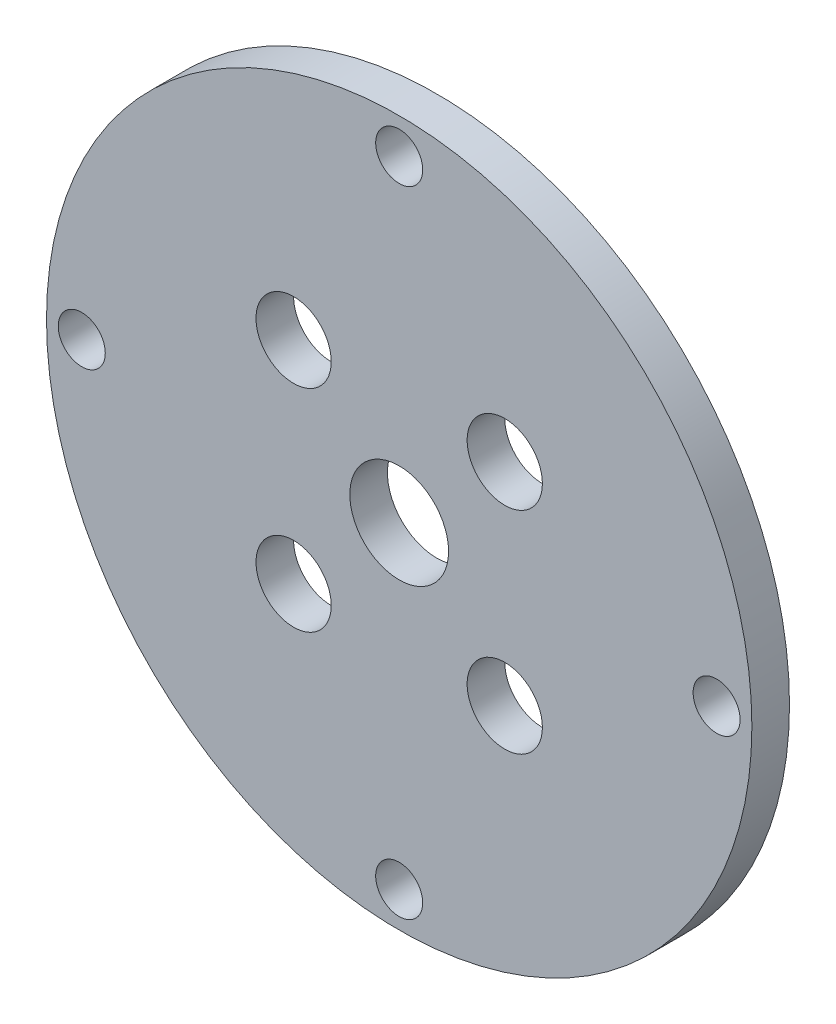
ISO-10303-21;
HEADER;
FILE_DESCRIPTION(('STEP AP214'),'2;1');
FILE_NAME('part.step','',(''),(''),'','','');
FILE_SCHEMA(('AUTOMOTIVE_DESIGN { 1 0 10303 214 1 1 1 1 }'));
ENDSEC;
DATA;
#1=APPLICATION_CONTEXT('core data for automotive mechanical design processes');
#2=APPLICATION_PROTOCOL_DEFINITION('international standard','automotive_design',2000,#1);
#3=PRODUCT_CONTEXT('',#1,'mechanical');
#4=PRODUCT('Part','Part','',(#3));
#5=PRODUCT_RELATED_PRODUCT_CATEGORY('part','',(#4));
#6=PRODUCT_DEFINITION_FORMATION('','',#4);
#7=PRODUCT_DEFINITION_CONTEXT('part definition',#1,'design');
#8=PRODUCT_DEFINITION('design','',#6,#7);
#9=PRODUCT_DEFINITION_SHAPE('','',#8);
#10=(LENGTH_UNIT() NAMED_UNIT(*) SI_UNIT(.MILLI.,.METRE.));
#11=(NAMED_UNIT(*) PLANE_ANGLE_UNIT() SI_UNIT($,.RADIAN.));
#12=(NAMED_UNIT(*) SI_UNIT($,.STERADIAN.) SOLID_ANGLE_UNIT());
#13=UNCERTAINTY_MEASURE_WITH_UNIT(LENGTH_MEASURE(1.E-05),#10,'distance_accuracy_value','');
#14=(GEOMETRIC_REPRESENTATION_CONTEXT(3) GLOBAL_UNCERTAINTY_ASSIGNED_CONTEXT((#13)) GLOBAL_UNIT_ASSIGNED_CONTEXT((#10,
#11,#12)) REPRESENTATION_CONTEXT('',''));
#15=CARTESIAN_POINT('',(0.,0.,0.));
#16=DIRECTION('',(0.,0.,1.));
#17=DIRECTION('',(1.,0.,0.));
#18=AXIS2_PLACEMENT_3D('',#15,#16,#17);
#19=CARTESIAN_POINT('',(0.,0.,1.6));
#20=DIRECTION('',(0.,0.,1.));
#21=DIRECTION('',(1.,0.,0.));
#22=AXIS2_PLACEMENT_3D('',#19,#20,#21);
#23=PLANE('',#22);
#24=CARTESIAN_POINT('',(7.62426335084362E-13,-13.5,1.6));
#25=DIRECTION('',(0.,0.,1.));
#26=DIRECTION('',(1.,0.,0.));
#27=AXIS2_PLACEMENT_3D('',#24,#25,#26);
#28=CIRCLE('',#27,1.00000000000082);
#29=CARTESIAN_POINT('',(1.00000000000158,-13.5,1.6));
#30=VERTEX_POINT('',#29);
#31=EDGE_CURVE('E83',#30,#30,#28,.T.);
#32=ORIENTED_EDGE('',*,*,#31,.F.);
#33=EDGE_LOOP('',(#32));
#34=FACE_BOUND('',#33,.T.);
#35=CARTESIAN_POINT('',(-4.49012806053458,4.49012806053432,1.6));
#36=DIRECTION('',(0.,0.,1.));
#37=DIRECTION('',(1.,0.,0.));
#38=AXIS2_PLACEMENT_3D('',#35,#36,#37);
#39=CIRCLE('',#38,1.60000000000027);
#40=CARTESIAN_POINT('',(-2.8901280605343,4.49012806053432,1.6));
#41=VERTEX_POINT('',#40);
#42=EDGE_CURVE('E71',#41,#41,#39,.T.);
#43=ORIENTED_EDGE('',*,*,#42,.F.);
#44=EDGE_LOOP('',(#43));
#45=FACE_BOUND('',#44,.T.);
#46=CARTESIAN_POINT('',(4.49012806053483,-4.49012806053458,1.6));
#47=DIRECTION('',(0.,0.,1.));
#48=DIRECTION('',(1.,0.,0.));
#49=AXIS2_PLACEMENT_3D('',#46,#47,#48);
#50=CIRCLE('',#49,1.59999999999994);
#51=CARTESIAN_POINT('',(6.09012806053476,-4.49012806053458,1.6));
#52=VERTEX_POINT('',#51);
#53=EDGE_CURVE('E59',#52,#52,#50,.T.);
#54=ORIENTED_EDGE('',*,*,#53,.F.);
#55=EDGE_LOOP('',(#54));
#56=FACE_BOUND('',#55,.T.);
#57=CARTESIAN_POINT('',(0.,0.,1.6));
#58=DIRECTION('',(0.,0.,1.));
#59=DIRECTION('',(1.,0.,0.));
#60=AXIS2_PLACEMENT_3D('',#57,#58,#59);
#61=CIRCLE('',#60,2.1);
#62=CARTESIAN_POINT('',(2.1,0.,1.6));
#63=VERTEX_POINT('',#62);
#64=EDGE_CURVE('E47',#63,#63,#61,.T.);
#65=ORIENTED_EDGE('',*,*,#64,.F.);
#66=EDGE_LOOP('',(#65));
#67=FACE_BOUND('',#66,.T.);
#68=CARTESIAN_POINT('',(0.,0.,1.6));
#69=DIRECTION('',(0.,0.,1.));
#70=DIRECTION('',(1.,0.,0.));
#71=AXIS2_PLACEMENT_3D('',#68,#69,#70);
#72=CIRCLE('',#71,15.);
#73=CARTESIAN_POINT('',(15.,0.,1.6));
#74=VERTEX_POINT('',#73);
#75=EDGE_CURVE('E10',#74,#74,#72,.T.);
#76=ORIENTED_EDGE('',*,*,#75,.T.);
#77=EDGE_LOOP('',(#76));
#78=FACE_BOUND('',#77,.T.);
#79=CARTESIAN_POINT('',(0.,13.5,1.6));
#80=DIRECTION('',(0.,0.,1.));
#81=DIRECTION('',(1.,0.,0.));
#82=AXIS2_PLACEMENT_3D('',#79,#80,#81);
#83=CIRCLE('',#82,1.);
#84=CARTESIAN_POINT('',(1.,13.5,1.6));
#85=VERTEX_POINT('',#84);
#86=EDGE_CURVE('E42',#85,#85,#83,.T.);
#87=ORIENTED_EDGE('',*,*,#86,.F.);
#88=EDGE_LOOP('',(#87));
#89=FACE_BOUND('',#88,.T.);
#90=CARTESIAN_POINT('',(4.49012806053458,4.49012806053458,1.6));
#91=DIRECTION('',(0.,0.,1.));
#92=DIRECTION('',(1.,0.,0.));
#93=AXIS2_PLACEMENT_3D('',#90,#91,#92);
#94=CIRCLE('',#93,1.6);
#95=CARTESIAN_POINT('',(6.09012806053458,4.49012806053458,1.6));
#96=VERTEX_POINT('',#95);
#97=EDGE_CURVE('E53',#96,#96,#94,.T.);
#98=ORIENTED_EDGE('',*,*,#97,.F.);
#99=EDGE_LOOP('',(#98));
#100=FACE_BOUND('',#99,.T.);
#101=CARTESIAN_POINT('',(-4.49012806053432,-4.49012806053483,1.6));
#102=DIRECTION('',(0.,0.,1.));
#103=DIRECTION('',(1.,0.,0.));
#104=AXIS2_PLACEMENT_3D('',#101,#102,#103);
#105=CIRCLE('',#104,1.60000000000019);
#106=CARTESIAN_POINT('',(-2.89012806053413,-4.49012806053483,1.6));
#107=VERTEX_POINT('',#106);
#108=EDGE_CURVE('E65',#107,#107,#105,.T.);
#109=ORIENTED_EDGE('',*,*,#108,.F.);
#110=EDGE_LOOP('',(#109));
#111=FACE_BOUND('',#110,.T.);
#112=CARTESIAN_POINT('',(13.5000000000004,3.81213167542181E-13,1.6));
#113=DIRECTION('',(0.,0.,1.));
#114=DIRECTION('',(1.,0.,0.));
#115=AXIS2_PLACEMENT_3D('',#112,#113,#114);
#116=CIRCLE('',#115,1.0000000000003);
#117=CARTESIAN_POINT('',(14.5000000000007,3.81213167542181E-13,1.6));
#118=VERTEX_POINT('',#117);
#119=EDGE_CURVE('E77',#118,#118,#116,.T.);
#120=ORIENTED_EDGE('',*,*,#119,.F.);
#121=EDGE_LOOP('',(#120));
#122=FACE_BOUND('',#121,.T.);
#123=CARTESIAN_POINT('',(-13.4999999999996,-3.8286644072103E-13,1.6));
#124=DIRECTION('',(0.,0.,1.));
#125=DIRECTION('',(1.,0.,0.));
#126=AXIS2_PLACEMENT_3D('',#123,#124,#125);
#127=CIRCLE('',#126,1.00000000000061);
#128=CARTESIAN_POINT('',(-12.499999999999,-3.8286644072103E-13,1.6));
#129=VERTEX_POINT('',#128);
#130=EDGE_CURVE('E89',#129,#129,#127,.T.);
#131=ORIENTED_EDGE('',*,*,#130,.F.);
#132=EDGE_LOOP('',(#131));
#133=FACE_BOUND('',#132,.T.);
#134=ADVANCED_FACE('F31',(#34,#45,#56,#67,#78,#89,#100,#111,#122,#133),#23,.T.);
#135=CARTESIAN_POINT('',(0.,0.,0.));
#136=DIRECTION('',(0.,0.,1.));
#137=DIRECTION('',(1.,0.,0.));
#138=AXIS2_PLACEMENT_3D('',#135,#136,#137);
#139=PLANE('',#138);
#140=CARTESIAN_POINT('',(0.,0.,0.));
#141=DIRECTION('',(0.,0.,1.));
#142=DIRECTION('',(1.,0.,0.));
#143=AXIS2_PLACEMENT_3D('',#140,#141,#142);
#144=CIRCLE('',#143,15.);
#145=CARTESIAN_POINT('',(15.,0.,0.));
#146=VERTEX_POINT('',#145);
#147=EDGE_CURVE('E35',#146,#146,#144,.T.);
#148=ORIENTED_EDGE('',*,*,#147,.F.);
#149=EDGE_LOOP('',(#148));
#150=FACE_BOUND('',#149,.T.);
#151=CARTESIAN_POINT('',(0.,13.5,0.));
#152=DIRECTION('',(0.,0.,1.));
#153=DIRECTION('',(1.,0.,0.));
#154=AXIS2_PLACEMENT_3D('',#151,#152,#153);
#155=CIRCLE('',#154,1.);
#156=CARTESIAN_POINT('',(1.,13.5,0.));
#157=VERTEX_POINT('',#156);
#158=EDGE_CURVE('E44',#157,#157,#155,.T.);
#159=ORIENTED_EDGE('',*,*,#158,.T.);
#160=EDGE_LOOP('',(#159));
#161=FACE_BOUND('',#160,.T.);
#162=CARTESIAN_POINT('',(0.,0.,0.));
#163=DIRECTION('',(0.,0.,1.));
#164=DIRECTION('',(1.,0.,0.));
#165=AXIS2_PLACEMENT_3D('',#162,#163,#164);
#166=CIRCLE('',#165,2.1);
#167=CARTESIAN_POINT('',(2.1,0.,0.));
#168=VERTEX_POINT('',#167);
#169=EDGE_CURVE('E50',#168,#168,#166,.T.);
#170=ORIENTED_EDGE('',*,*,#169,.T.);
#171=EDGE_LOOP('',(#170));
#172=FACE_BOUND('',#171,.T.);
#173=CARTESIAN_POINT('',(4.49012806053458,4.49012806053458,0.));
#174=DIRECTION('',(0.,0.,1.));
#175=DIRECTION('',(1.,0.,0.));
#176=AXIS2_PLACEMENT_3D('',#173,#174,#175);
#177=CIRCLE('',#176,1.6);
#178=CARTESIAN_POINT('',(6.09012806053458,4.49012806053458,0.));
#179=VERTEX_POINT('',#178);
#180=EDGE_CURVE('E56',#179,#179,#177,.T.);
#181=ORIENTED_EDGE('',*,*,#180,.T.);
#182=EDGE_LOOP('',(#181));
#183=FACE_BOUND('',#182,.T.);
#184=CARTESIAN_POINT('',(4.49012806053483,-4.49012806053458,0.));
#185=DIRECTION('',(0.,0.,1.));
#186=DIRECTION('',(1.,0.,0.));
#187=AXIS2_PLACEMENT_3D('',#184,#185,#186);
#188=CIRCLE('',#187,1.59999999999994);
#189=CARTESIAN_POINT('',(6.09012806053476,-4.49012806053458,0.));
#190=VERTEX_POINT('',#189);
#191=EDGE_CURVE('E62',#190,#190,#188,.T.);
#192=ORIENTED_EDGE('',*,*,#191,.T.);
#193=EDGE_LOOP('',(#192));
#194=FACE_BOUND('',#193,.T.);
#195=CARTESIAN_POINT('',(-4.49012806053432,-4.49012806053483,0.));
#196=DIRECTION('',(0.,0.,1.));
#197=DIRECTION('',(1.,0.,0.));
#198=AXIS2_PLACEMENT_3D('',#195,#196,#197);
#199=CIRCLE('',#198,1.60000000000019);
#200=CARTESIAN_POINT('',(-2.89012806053413,-4.49012806053483,0.));
#201=VERTEX_POINT('',#200);
#202=EDGE_CURVE('E68',#201,#201,#199,.T.);
#203=ORIENTED_EDGE('',*,*,#202,.T.);
#204=EDGE_LOOP('',(#203));
#205=FACE_BOUND('',#204,.T.);
#206=CARTESIAN_POINT('',(-4.49012806053458,4.49012806053432,0.));
#207=DIRECTION('',(0.,0.,1.));
#208=DIRECTION('',(1.,0.,0.));
#209=AXIS2_PLACEMENT_3D('',#206,#207,#208);
#210=CIRCLE('',#209,1.60000000000027);
#211=CARTESIAN_POINT('',(-2.8901280605343,4.49012806053432,0.));
#212=VERTEX_POINT('',#211);
#213=EDGE_CURVE('E74',#212,#212,#210,.T.);
#214=ORIENTED_EDGE('',*,*,#213,.T.);
#215=EDGE_LOOP('',(#214));
#216=FACE_BOUND('',#215,.T.);
#217=CARTESIAN_POINT('',(13.5000000000004,3.81213167542181E-13,0.));
#218=DIRECTION('',(0.,0.,1.));
#219=DIRECTION('',(1.,0.,0.));
#220=AXIS2_PLACEMENT_3D('',#217,#218,#219);
#221=CIRCLE('',#220,1.0000000000003);
#222=CARTESIAN_POINT('',(14.5000000000007,3.81213167542181E-13,0.));
#223=VERTEX_POINT('',#222);
#224=EDGE_CURVE('E80',#223,#223,#221,.T.);
#225=ORIENTED_EDGE('',*,*,#224,.T.);
#226=EDGE_LOOP('',(#225));
#227=FACE_BOUND('',#226,.T.);
#228=CARTESIAN_POINT('',(7.62426335084362E-13,-13.5,0.));
#229=DIRECTION('',(0.,0.,1.));
#230=DIRECTION('',(1.,0.,0.));
#231=AXIS2_PLACEMENT_3D('',#228,#229,#230);
#232=CIRCLE('',#231,1.00000000000082);
#233=CARTESIAN_POINT('',(1.00000000000158,-13.5,0.));
#234=VERTEX_POINT('',#233);
#235=EDGE_CURVE('E86',#234,#234,#232,.T.);
#236=ORIENTED_EDGE('',*,*,#235,.T.);
#237=EDGE_LOOP('',(#236));
#238=FACE_BOUND('',#237,.T.);
#239=CARTESIAN_POINT('',(-13.4999999999996,-3.8286644072103E-13,0.));
#240=DIRECTION('',(0.,0.,1.));
#241=DIRECTION('',(1.,0.,0.));
#242=AXIS2_PLACEMENT_3D('',#239,#240,#241);
#243=CIRCLE('',#242,1.00000000000061);
#244=CARTESIAN_POINT('',(-12.499999999999,-3.8286644072103E-13,0.));
#245=VERTEX_POINT('',#244);
#246=EDGE_CURVE('E92',#245,#245,#243,.T.);
#247=ORIENTED_EDGE('',*,*,#246,.T.);
#248=EDGE_LOOP('',(#247));
#249=FACE_BOUND('',#248,.T.);
#250=ADVANCED_FACE('F102',(#150,#161,#172,#183,#194,#205,#216,#227,#238,#249),#139,.F.);
#251=CARTESIAN_POINT('',(0.,0.,1.6));
#252=DIRECTION('',(0.,0.,-1.));
#253=DIRECTION('',(-1.,0.,0.));
#254=AXIS2_PLACEMENT_3D('',#251,#252,#253);
#255=CYLINDRICAL_SURFACE('',#254,15.);
#256=ORIENTED_EDGE('',*,*,#75,.F.);
#257=EDGE_LOOP('',(#256));
#258=FACE_BOUND('',#257,.T.);
#259=ORIENTED_EDGE('',*,*,#147,.T.);
#260=EDGE_LOOP('',(#259));
#261=FACE_BOUND('',#260,.T.);
#262=ADVANCED_FACE('F33',(#258,#261),#255,.T.);
#263=CARTESIAN_POINT('',(0.,13.5,1.6));
#264=DIRECTION('',(0.,0.,-1.));
#265=DIRECTION('',(-1.,0.,0.));
#266=AXIS2_PLACEMENT_3D('',#263,#264,#265);
#267=CYLINDRICAL_SURFACE('',#266,1.);
#268=ORIENTED_EDGE('',*,*,#86,.T.);
#269=EDGE_LOOP('',(#268));
#270=FACE_BOUND('',#269,.T.);
#271=ORIENTED_EDGE('',*,*,#158,.F.);
#272=EDGE_LOOP('',(#271));
#273=FACE_BOUND('',#272,.T.);
#274=ADVANCED_FACE('F112',(#270,#273),#267,.F.);
#275=CARTESIAN_POINT('',(0.,0.,1.6));
#276=DIRECTION('',(0.,0.,-1.));
#277=DIRECTION('',(-1.,0.,0.));
#278=AXIS2_PLACEMENT_3D('',#275,#276,#277);
#279=CYLINDRICAL_SURFACE('',#278,2.1);
#280=ORIENTED_EDGE('',*,*,#64,.T.);
#281=EDGE_LOOP('',(#280));
#282=FACE_BOUND('',#281,.T.);
#283=ORIENTED_EDGE('',*,*,#169,.F.);
#284=EDGE_LOOP('',(#283));
#285=FACE_BOUND('',#284,.T.);
#286=ADVANCED_FACE('F115',(#282,#285),#279,.F.);
#287=CARTESIAN_POINT('',(4.49012806053458,4.49012806053458,1.6));
#288=DIRECTION('',(0.,0.,-1.));
#289=DIRECTION('',(-1.,0.,0.));
#290=AXIS2_PLACEMENT_3D('',#287,#288,#289);
#291=CYLINDRICAL_SURFACE('',#290,1.6);
#292=ORIENTED_EDGE('',*,*,#97,.T.);
#293=EDGE_LOOP('',(#292));
#294=FACE_BOUND('',#293,.T.);
#295=ORIENTED_EDGE('',*,*,#180,.F.);
#296=EDGE_LOOP('',(#295));
#297=FACE_BOUND('',#296,.T.);
#298=ADVANCED_FACE('F119',(#294,#297),#291,.F.);
#299=CARTESIAN_POINT('',(4.49012806053483,-4.49012806053458,1.6));
#300=DIRECTION('',(0.,0.,-1.));
#301=DIRECTION('',(-1.,0.,0.));
#302=AXIS2_PLACEMENT_3D('',#299,#300,#301);
#303=CYLINDRICAL_SURFACE('',#302,1.59999999999994);
#304=ORIENTED_EDGE('',*,*,#53,.T.);
#305=EDGE_LOOP('',(#304));
#306=FACE_BOUND('',#305,.T.);
#307=ORIENTED_EDGE('',*,*,#191,.F.);
#308=EDGE_LOOP('',(#307));
#309=FACE_BOUND('',#308,.T.);
#310=ADVANCED_FACE('F123',(#306,#309),#303,.F.);
#311=CARTESIAN_POINT('',(-4.49012806053432,-4.49012806053483,1.6));
#312=DIRECTION('',(0.,0.,-1.));
#313=DIRECTION('',(-1.,0.,0.));
#314=AXIS2_PLACEMENT_3D('',#311,#312,#313);
#315=CYLINDRICAL_SURFACE('',#314,1.60000000000019);
#316=ORIENTED_EDGE('',*,*,#108,.T.);
#317=EDGE_LOOP('',(#316));
#318=FACE_BOUND('',#317,.T.);
#319=ORIENTED_EDGE('',*,*,#202,.F.);
#320=EDGE_LOOP('',(#319));
#321=FACE_BOUND('',#320,.T.);
#322=ADVANCED_FACE('F127',(#318,#321),#315,.F.);
#323=CARTESIAN_POINT('',(-4.49012806053458,4.49012806053432,1.6));
#324=DIRECTION('',(0.,0.,-1.));
#325=DIRECTION('',(-1.,0.,0.));
#326=AXIS2_PLACEMENT_3D('',#323,#324,#325);
#327=CYLINDRICAL_SURFACE('',#326,1.60000000000027);
#328=ORIENTED_EDGE('',*,*,#42,.T.);
#329=EDGE_LOOP('',(#328));
#330=FACE_BOUND('',#329,.T.);
#331=ORIENTED_EDGE('',*,*,#213,.F.);
#332=EDGE_LOOP('',(#331));
#333=FACE_BOUND('',#332,.T.);
#334=ADVANCED_FACE('F131',(#330,#333),#327,.F.);
#335=CARTESIAN_POINT('',(13.5000000000004,3.81213167542181E-13,1.6));
#336=DIRECTION('',(0.,0.,-1.));
#337=DIRECTION('',(-1.,0.,0.));
#338=AXIS2_PLACEMENT_3D('',#335,#336,#337);
#339=CYLINDRICAL_SURFACE('',#338,1.0000000000003);
#340=ORIENTED_EDGE('',*,*,#119,.T.);
#341=EDGE_LOOP('',(#340));
#342=FACE_BOUND('',#341,.T.);
#343=ORIENTED_EDGE('',*,*,#224,.F.);
#344=EDGE_LOOP('',(#343));
#345=FACE_BOUND('',#344,.T.);
#346=ADVANCED_FACE('F135',(#342,#345),#339,.F.);
#347=CARTESIAN_POINT('',(7.62426335084362E-13,-13.5,1.6));
#348=DIRECTION('',(0.,0.,-1.));
#349=DIRECTION('',(-1.,0.,0.));
#350=AXIS2_PLACEMENT_3D('',#347,#348,#349);
#351=CYLINDRICAL_SURFACE('',#350,1.00000000000082);
#352=ORIENTED_EDGE('',*,*,#31,.T.);
#353=EDGE_LOOP('',(#352));
#354=FACE_BOUND('',#353,.T.);
#355=ORIENTED_EDGE('',*,*,#235,.F.);
#356=EDGE_LOOP('',(#355));
#357=FACE_BOUND('',#356,.T.);
#358=ADVANCED_FACE('F139',(#354,#357),#351,.F.);
#359=CARTESIAN_POINT('',(-13.4999999999996,-3.8286644072103E-13,1.6));
#360=DIRECTION('',(0.,0.,-1.));
#361=DIRECTION('',(-1.,0.,0.));
#362=AXIS2_PLACEMENT_3D('',#359,#360,#361);
#363=CYLINDRICAL_SURFACE('',#362,1.00000000000061);
#364=ORIENTED_EDGE('',*,*,#130,.T.);
#365=EDGE_LOOP('',(#364));
#366=FACE_BOUND('',#365,.T.);
#367=ORIENTED_EDGE('',*,*,#246,.F.);
#368=EDGE_LOOP('',(#367));
#369=FACE_BOUND('',#368,.T.);
#370=ADVANCED_FACE('F98',(#366,#369),#363,.F.);
#371=CLOSED_SHELL('',(#134,#250,#262,#274,#286,#298,#310,#322,#334,#346,#358,#370));
#372=MANIFOLD_SOLID_BREP('B2',#371);
#373=ADVANCED_BREP_SHAPE_REPRESENTATION('',(#18,#372),#14);
#374=SHAPE_DEFINITION_REPRESENTATION(#9,#373);
ENDSEC;
END-ISO-10303-21;
